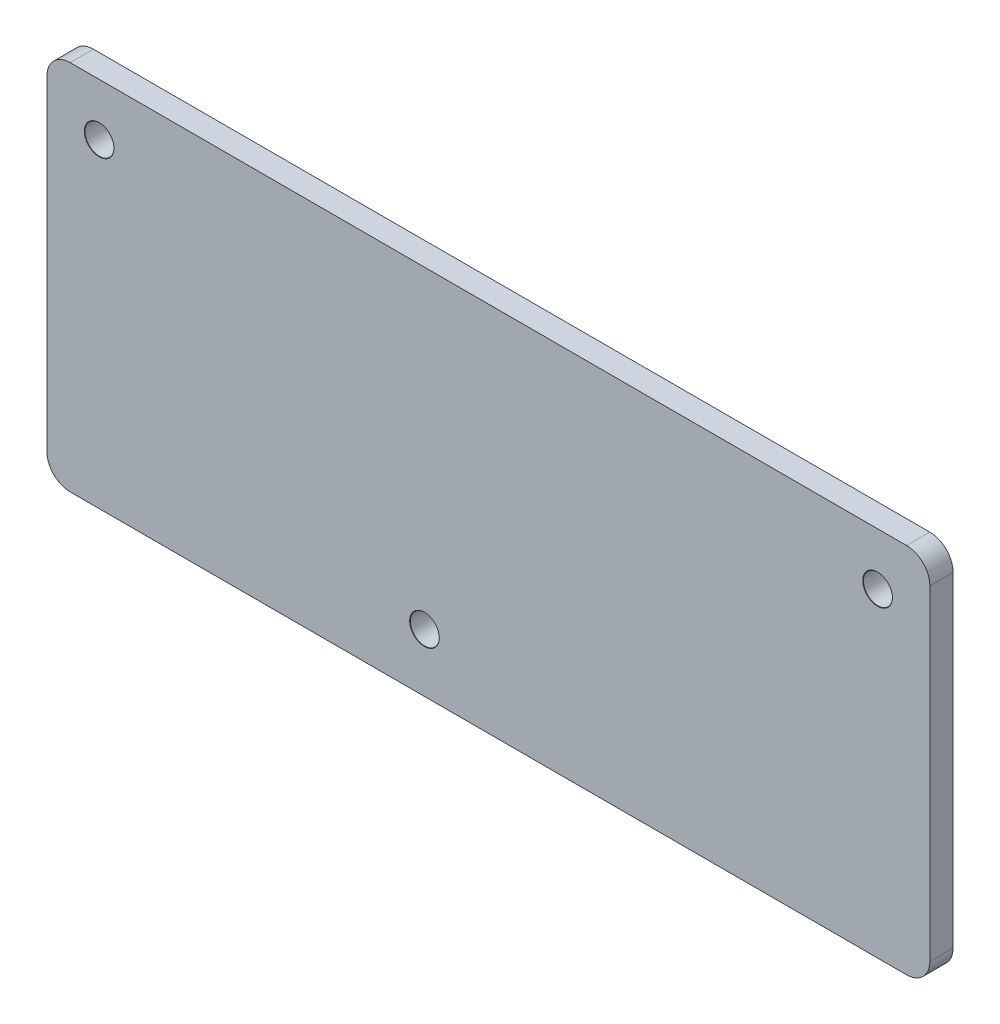
ISO-10303-21;
HEADER;
FILE_DESCRIPTION(('STEP AP214'),'2;1');
FILE_NAME('part.step','',(''),(''),'','','');
FILE_SCHEMA(('AUTOMOTIVE_DESIGN { 1 0 10303 214 1 1 1 1 }'));
ENDSEC;
DATA;
#1=APPLICATION_CONTEXT('core data for automotive mechanical design processes');
#2=APPLICATION_PROTOCOL_DEFINITION('international standard','automotive_design',2000,#1);
#3=PRODUCT_CONTEXT('',#1,'mechanical');
#4=PRODUCT('Part','Part','',(#3));
#5=PRODUCT_RELATED_PRODUCT_CATEGORY('part','',(#4));
#6=PRODUCT_DEFINITION_FORMATION('','',#4);
#7=PRODUCT_DEFINITION_CONTEXT('part definition',#1,'design');
#8=PRODUCT_DEFINITION('design','',#6,#7);
#9=PRODUCT_DEFINITION_SHAPE('','',#8);
#10=(LENGTH_UNIT() NAMED_UNIT(*) SI_UNIT(.MILLI.,.METRE.));
#11=(NAMED_UNIT(*) PLANE_ANGLE_UNIT() SI_UNIT($,.RADIAN.));
#12=(NAMED_UNIT(*) SI_UNIT($,.STERADIAN.) SOLID_ANGLE_UNIT());
#13=UNCERTAINTY_MEASURE_WITH_UNIT(LENGTH_MEASURE(1.E-05),#10,'distance_accuracy_value','');
#14=(GEOMETRIC_REPRESENTATION_CONTEXT(3) GLOBAL_UNCERTAINTY_ASSIGNED_CONTEXT((#13)) GLOBAL_UNIT_ASSIGNED_CONTEXT((#10,
#11,#12)) REPRESENTATION_CONTEXT('',''));
#15=CARTESIAN_POINT('',(0.,0.,0.));
#16=DIRECTION('',(0.,0.,1.));
#17=DIRECTION('',(1.,0.,0.));
#18=AXIS2_PLACEMENT_3D('',#15,#16,#17);
#19=CARTESIAN_POINT('',(-36.,14.,2.));
#20=DIRECTION('',(0.,0.,-1.));
#21=DIRECTION('',(-1.,0.,0.));
#22=AXIS2_PLACEMENT_3D('',#19,#20,#21);
#23=CYLINDRICAL_SURFACE('',#22,2.);
#24=CARTESIAN_POINT('',(-36.,14.,0.));
#25=DIRECTION('',(0.,0.,1.));
#26=DIRECTION('',(1.,0.,0.));
#27=AXIS2_PLACEMENT_3D('',#24,#25,#26);
#28=CIRCLE('',#27,2.);
#29=CARTESIAN_POINT('',(-36.,16.,0.));
#30=VERTEX_POINT('',#29);
#31=CARTESIAN_POINT('',(-38.,14.,0.));
#32=VERTEX_POINT('',#31);
#33=EDGE_CURVE('E139',#30,#32,#28,.T.);
#34=ORIENTED_EDGE('',*,*,#33,.T.);
#35=DIRECTION('',(0.,0.,-1.));
#36=VECTOR('',#35,1.);
#37=CARTESIAN_POINT('',(-38.,14.,2.));
#38=LINE('',#37,#36);
#39=CARTESIAN_POINT('',(-38.,14.,2.));
#40=VERTEX_POINT('',#39);
#41=EDGE_CURVE('E11',#40,#32,#38,.T.);
#42=ORIENTED_EDGE('',*,*,#41,.F.);
#43=CARTESIAN_POINT('',(-36.,14.,2.));
#44=DIRECTION('',(0.,0.,1.));
#45=DIRECTION('',(1.,0.,0.));
#46=AXIS2_PLACEMENT_3D('',#43,#44,#45);
#47=CIRCLE('',#46,2.);
#48=CARTESIAN_POINT('',(-36.,16.,2.));
#49=VERTEX_POINT('',#48);
#50=EDGE_CURVE('E162',#49,#40,#47,.T.);
#51=ORIENTED_EDGE('',*,*,#50,.F.);
#52=DIRECTION('',(0.,0.,-1.));
#53=VECTOR('',#52,1.);
#54=CARTESIAN_POINT('',(-36.,16.,2.));
#55=LINE('',#54,#53);
#56=EDGE_CURVE('E135',#49,#30,#55,.T.);
#57=ORIENTED_EDGE('',*,*,#56,.T.);
#58=EDGE_LOOP('',(#34,#42,#51,#57));
#59=FACE_BOUND('',#58,.T.);
#60=ADVANCED_FACE('F38',(#59),#23,.T.);
#61=CARTESIAN_POINT('',(-38.,14.,2.));
#62=DIRECTION('',(1.,0.,0.));
#63=DIRECTION('',(0.,1.,0.));
#64=AXIS2_PLACEMENT_3D('',#61,#62,#63);
#65=PLANE('',#64);
#66=DIRECTION('',(0.,-1.,0.));
#67=VECTOR('',#66,1.);
#68=CARTESIAN_POINT('',(-38.,14.,0.));
#69=LINE('',#68,#67);
#70=CARTESIAN_POINT('',(-38.,-14.,0.));
#71=VERTEX_POINT('',#70);
#72=EDGE_CURVE('E143',#32,#71,#69,.T.);
#73=ORIENTED_EDGE('',*,*,#72,.T.);
#74=DIRECTION('',(0.,0.,-1.));
#75=VECTOR('',#74,1.);
#76=CARTESIAN_POINT('',(-38.,-14.,2.));
#77=LINE('',#76,#75);
#78=CARTESIAN_POINT('',(-38.,-14.,2.));
#79=VERTEX_POINT('',#78);
#80=EDGE_CURVE('E47',#79,#71,#77,.T.);
#81=ORIENTED_EDGE('',*,*,#80,.F.);
#82=DIRECTION('',(0.,-1.,0.));
#83=VECTOR('',#82,1.);
#84=CARTESIAN_POINT('',(-38.,14.,2.));
#85=LINE('',#84,#83);
#86=EDGE_CURVE('E98',#40,#79,#85,.T.);
#87=ORIENTED_EDGE('',*,*,#86,.F.);
#88=ORIENTED_EDGE('',*,*,#41,.T.);
#89=EDGE_LOOP('',(#73,#81,#87,#88));
#90=FACE_BOUND('',#89,.T.);
#91=ADVANCED_FACE('F269',(#90),#65,.F.);
#92=CARTESIAN_POINT('',(-36.,-14.,2.));
#93=DIRECTION('',(0.,0.,-1.));
#94=DIRECTION('',(-1.,0.,0.));
#95=AXIS2_PLACEMENT_3D('',#92,#93,#94);
#96=CYLINDRICAL_SURFACE('',#95,2.);
#97=CARTESIAN_POINT('',(-36.,-14.,0.));
#98=DIRECTION('',(0.,0.,1.));
#99=DIRECTION('',(1.,0.,0.));
#100=AXIS2_PLACEMENT_3D('',#97,#98,#99);
#101=CIRCLE('',#100,2.);
#102=CARTESIAN_POINT('',(-36.,-16.,0.));
#103=VERTEX_POINT('',#102);
#104=EDGE_CURVE('E147',#71,#103,#101,.T.);
#105=ORIENTED_EDGE('',*,*,#104,.T.);
#106=DIRECTION('',(0.,0.,-1.));
#107=VECTOR('',#106,1.);
#108=CARTESIAN_POINT('',(-36.,-16.,2.));
#109=LINE('',#108,#107);
#110=CARTESIAN_POINT('',(-36.,-16.,2.));
#111=VERTEX_POINT('',#110);
#112=EDGE_CURVE('E173',#111,#103,#109,.T.);
#113=ORIENTED_EDGE('',*,*,#112,.F.);
#114=CARTESIAN_POINT('',(-36.,-14.,2.));
#115=DIRECTION('',(0.,0.,1.));
#116=DIRECTION('',(1.,0.,0.));
#117=AXIS2_PLACEMENT_3D('',#114,#115,#116);
#118=CIRCLE('',#117,2.);
#119=EDGE_CURVE('E183',#79,#111,#118,.T.);
#120=ORIENTED_EDGE('',*,*,#119,.F.);
#121=ORIENTED_EDGE('',*,*,#80,.T.);
#122=EDGE_LOOP('',(#105,#113,#120,#121));
#123=FACE_BOUND('',#122,.T.);
#124=ADVANCED_FACE('F181',(#123),#96,.T.);
#125=CARTESIAN_POINT('',(-36.,-16.,2.));
#126=DIRECTION('',(0.,1.,0.));
#127=DIRECTION('',(0.,0.,1.));
#128=AXIS2_PLACEMENT_3D('',#125,#126,#127);
#129=PLANE('',#128);
#130=DIRECTION('',(1.,0.,0.));
#131=VECTOR('',#130,1.);
#132=CARTESIAN_POINT('',(-36.,-16.,0.));
#133=LINE('',#132,#131);
#134=CARTESIAN_POINT('',(36.,-16.,0.));
#135=VERTEX_POINT('',#134);
#136=EDGE_CURVE('E150',#103,#135,#133,.T.);
#137=ORIENTED_EDGE('',*,*,#136,.T.);
#138=DIRECTION('',(0.,0.,-1.));
#139=VECTOR('',#138,1.);
#140=CARTESIAN_POINT('',(36.,-16.,2.));
#141=LINE('',#140,#139);
#142=CARTESIAN_POINT('',(36.,-16.,2.));
#143=VERTEX_POINT('',#142);
#144=EDGE_CURVE('E169',#143,#135,#141,.T.);
#145=ORIENTED_EDGE('',*,*,#144,.F.);
#146=DIRECTION('',(1.,0.,0.));
#147=VECTOR('',#146,1.);
#148=CARTESIAN_POINT('',(-36.,-16.,2.));
#149=LINE('',#148,#147);
#150=EDGE_CURVE('E196',#111,#143,#149,.T.);
#151=ORIENTED_EDGE('',*,*,#150,.F.);
#152=ORIENTED_EDGE('',*,*,#112,.T.);
#153=EDGE_LOOP('',(#137,#145,#151,#152));
#154=FACE_BOUND('',#153,.T.);
#155=ADVANCED_FACE('F191',(#154),#129,.F.);
#156=CARTESIAN_POINT('',(36.,-14.,2.));
#157=DIRECTION('',(0.,0.,-1.));
#158=DIRECTION('',(-1.,0.,0.));
#159=AXIS2_PLACEMENT_3D('',#156,#157,#158);
#160=CYLINDRICAL_SURFACE('',#159,2.);
#161=CARTESIAN_POINT('',(36.,-14.,0.));
#162=DIRECTION('',(0.,0.,1.));
#163=DIRECTION('',(1.,0.,0.));
#164=AXIS2_PLACEMENT_3D('',#161,#162,#163);
#165=CIRCLE('',#164,2.);
#166=CARTESIAN_POINT('',(38.,-14.,0.));
#167=VERTEX_POINT('',#166);
#168=EDGE_CURVE('E153',#135,#167,#165,.T.);
#169=ORIENTED_EDGE('',*,*,#168,.T.);
#170=DIRECTION('',(0.,0.,-1.));
#171=VECTOR('',#170,1.);
#172=CARTESIAN_POINT('',(38.,-14.,2.));
#173=LINE('',#172,#171);
#174=CARTESIAN_POINT('',(38.,-14.,2.));
#175=VERTEX_POINT('',#174);
#176=EDGE_CURVE('E128',#175,#167,#173,.T.);
#177=ORIENTED_EDGE('',*,*,#176,.F.);
#178=CARTESIAN_POINT('',(36.,-14.,2.));
#179=DIRECTION('',(0.,0.,1.));
#180=DIRECTION('',(1.,0.,0.));
#181=AXIS2_PLACEMENT_3D('',#178,#179,#180);
#182=CIRCLE('',#181,2.);
#183=EDGE_CURVE('E117',#143,#175,#182,.T.);
#184=ORIENTED_EDGE('',*,*,#183,.F.);
#185=ORIENTED_EDGE('',*,*,#144,.T.);
#186=EDGE_LOOP('',(#169,#177,#184,#185));
#187=FACE_BOUND('',#186,.T.);
#188=ADVANCED_FACE('F194',(#187),#160,.T.);
#189=CARTESIAN_POINT('',(38.,-14.,2.));
#190=DIRECTION('',(-1.,0.,0.));
#191=DIRECTION('',(0.,-1.,0.));
#192=AXIS2_PLACEMENT_3D('',#189,#190,#191);
#193=PLANE('',#192);
#194=DIRECTION('',(0.,1.,0.));
#195=VECTOR('',#194,1.);
#196=CARTESIAN_POINT('',(38.,-14.,0.));
#197=LINE('',#196,#195);
#198=CARTESIAN_POINT('',(38.,14.,0.));
#199=VERTEX_POINT('',#198);
#200=EDGE_CURVE('E126',#167,#199,#197,.T.);
#201=ORIENTED_EDGE('',*,*,#200,.T.);
#202=DIRECTION('',(0.,0.,-1.));
#203=VECTOR('',#202,1.);
#204=CARTESIAN_POINT('',(38.,14.,2.));
#205=LINE('',#204,#203);
#206=CARTESIAN_POINT('',(38.,14.,2.));
#207=VERTEX_POINT('',#206);
#208=EDGE_CURVE('E123',#207,#199,#205,.T.);
#209=ORIENTED_EDGE('',*,*,#208,.F.);
#210=DIRECTION('',(0.,1.,0.));
#211=VECTOR('',#210,1.);
#212=CARTESIAN_POINT('',(38.,-14.,2.));
#213=LINE('',#212,#211);
#214=EDGE_CURVE('E111',#175,#207,#213,.T.);
#215=ORIENTED_EDGE('',*,*,#214,.F.);
#216=ORIENTED_EDGE('',*,*,#176,.T.);
#217=EDGE_LOOP('',(#201,#209,#215,#216));
#218=FACE_BOUND('',#217,.T.);
#219=ADVANCED_FACE('F124',(#218),#193,.F.);
#220=CARTESIAN_POINT('',(36.,14.,2.));
#221=DIRECTION('',(0.,0.,-1.));
#222=DIRECTION('',(-1.,0.,0.));
#223=AXIS2_PLACEMENT_3D('',#220,#221,#222);
#224=CYLINDRICAL_SURFACE('',#223,2.);
#225=CARTESIAN_POINT('',(36.,14.,0.));
#226=DIRECTION('',(0.,0.,1.));
#227=DIRECTION('',(1.,0.,0.));
#228=AXIS2_PLACEMENT_3D('',#225,#226,#227);
#229=CIRCLE('',#228,2.);
#230=CARTESIAN_POINT('',(36.,16.,0.));
#231=VERTEX_POINT('',#230);
#232=EDGE_CURVE('E84',#199,#231,#229,.T.);
#233=ORIENTED_EDGE('',*,*,#232,.T.);
#234=DIRECTION('',(0.,0.,-1.));
#235=VECTOR('',#234,1.);
#236=CARTESIAN_POINT('',(36.,16.,2.));
#237=LINE('',#236,#235);
#238=CARTESIAN_POINT('',(36.,16.,2.));
#239=VERTEX_POINT('',#238);
#240=EDGE_CURVE('E129',#239,#231,#237,.T.);
#241=ORIENTED_EDGE('',*,*,#240,.F.);
#242=CARTESIAN_POINT('',(36.,14.,2.));
#243=DIRECTION('',(0.,0.,1.));
#244=DIRECTION('',(1.,0.,0.));
#245=AXIS2_PLACEMENT_3D('',#242,#243,#244);
#246=CIRCLE('',#245,2.);
#247=EDGE_CURVE('E115',#207,#239,#246,.T.);
#248=ORIENTED_EDGE('',*,*,#247,.F.);
#249=ORIENTED_EDGE('',*,*,#208,.T.);
#250=EDGE_LOOP('',(#233,#241,#248,#249));
#251=FACE_BOUND('',#250,.T.);
#252=ADVANCED_FACE('F131',(#251),#224,.T.);
#253=CARTESIAN_POINT('',(36.,16.,2.));
#254=DIRECTION('',(0.,-1.,0.));
#255=DIRECTION('',(1.,0.,0.));
#256=AXIS2_PLACEMENT_3D('',#253,#254,#255);
#257=PLANE('',#256);
#258=DIRECTION('',(-1.,0.,0.));
#259=VECTOR('',#258,1.);
#260=CARTESIAN_POINT('',(36.,16.,0.));
#261=LINE('',#260,#259);
#262=EDGE_CURVE('E90',#231,#30,#261,.T.);
#263=ORIENTED_EDGE('',*,*,#262,.T.);
#264=ORIENTED_EDGE('',*,*,#56,.F.);
#265=DIRECTION('',(-1.,0.,0.));
#266=VECTOR('',#265,1.);
#267=CARTESIAN_POINT('',(36.,16.,2.));
#268=LINE('',#267,#266);
#269=EDGE_CURVE('E55',#239,#49,#268,.T.);
#270=ORIENTED_EDGE('',*,*,#269,.F.);
#271=ORIENTED_EDGE('',*,*,#240,.T.);
#272=EDGE_LOOP('',(#263,#264,#270,#271));
#273=FACE_BOUND('',#272,.T.);
#274=ADVANCED_FACE('F246',(#273),#257,.F.);
#275=CARTESIAN_POINT('',(-36.,14.,2.));
#276=DIRECTION('',(0.,0.,1.));
#277=DIRECTION('',(1.,0.,0.));
#278=AXIS2_PLACEMENT_3D('',#275,#276,#277);
#279=PLANE('',#278);
#280=CARTESIAN_POINT('',(-33.5,11.5,2.));
#281=DIRECTION('',(0.,0.,1.));
#282=DIRECTION('',(1.,0.,0.));
#283=AXIS2_PLACEMENT_3D('',#280,#281,#282);
#284=CIRCLE('',#283,1.275);
#285=CARTESIAN_POINT('',(-32.225,11.5,2.));
#286=VERTEX_POINT('',#285);
#287=EDGE_CURVE('E237',#286,#286,#284,.T.);
#288=ORIENTED_EDGE('',*,*,#287,.F.);
#289=EDGE_LOOP('',(#288));
#290=FACE_BOUND('',#289,.T.);
#291=CARTESIAN_POINT('',(-5.50000000000001,-11.,2.));
#292=DIRECTION('',(0.,0.,1.));
#293=DIRECTION('',(1.,0.,0.));
#294=AXIS2_PLACEMENT_3D('',#291,#292,#293);
#295=CIRCLE('',#294,1.275);
#296=CARTESIAN_POINT('',(-4.225,-11.,2.));
#297=VERTEX_POINT('',#296);
#298=EDGE_CURVE('E225',#297,#297,#295,.T.);
#299=ORIENTED_EDGE('',*,*,#298,.F.);
#300=EDGE_LOOP('',(#299));
#301=FACE_BOUND('',#300,.T.);
#302=CARTESIAN_POINT('',(33.5,11.5,2.));
#303=DIRECTION('',(0.,0.,1.));
#304=DIRECTION('',(1.,0.,0.));
#305=AXIS2_PLACEMENT_3D('',#302,#303,#304);
#306=CIRCLE('',#305,1.275);
#307=CARTESIAN_POINT('',(34.775,11.5,2.));
#308=VERTEX_POINT('',#307);
#309=EDGE_CURVE('E213',#308,#308,#306,.T.);
#310=ORIENTED_EDGE('',*,*,#309,.F.);
#311=EDGE_LOOP('',(#310));
#312=FACE_BOUND('',#311,.T.);
#313=ORIENTED_EDGE('',*,*,#50,.T.);
#314=ORIENTED_EDGE('',*,*,#86,.T.);
#315=ORIENTED_EDGE('',*,*,#119,.T.);
#316=ORIENTED_EDGE('',*,*,#150,.T.);
#317=ORIENTED_EDGE('',*,*,#183,.T.);
#318=ORIENTED_EDGE('',*,*,#214,.T.);
#319=ORIENTED_EDGE('',*,*,#247,.T.);
#320=ORIENTED_EDGE('',*,*,#269,.T.);
#321=EDGE_LOOP('',(#313,#314,#315,#316,#317,#318,#319,#320));
#322=FACE_BOUND('',#321,.T.);
#323=ADVANCED_FACE('F113',(#290,#301,#312,#322),#279,.T.);
#324=CARTESIAN_POINT('',(-36.,14.,0.));
#325=DIRECTION('',(0.,0.,1.));
#326=DIRECTION('',(1.,0.,0.));
#327=AXIS2_PLACEMENT_3D('',#324,#325,#326);
#328=PLANE('',#327);
#329=CARTESIAN_POINT('',(-33.5,11.5,0.));
#330=DIRECTION('',(0.,0.,1.));
#331=DIRECTION('',(1.,0.,0.));
#332=AXIS2_PLACEMENT_3D('',#329,#330,#331);
#333=CIRCLE('',#332,1.25);
#334=CARTESIAN_POINT('',(-32.25,11.5,0.));
#335=VERTEX_POINT('',#334);
#336=EDGE_CURVE('E229',#335,#335,#333,.T.);
#337=ORIENTED_EDGE('',*,*,#336,.T.);
#338=EDGE_LOOP('',(#337));
#339=FACE_BOUND('',#338,.T.);
#340=CARTESIAN_POINT('',(-5.50000000000001,-11.,0.));
#341=DIRECTION('',(0.,0.,1.));
#342=DIRECTION('',(1.,0.,0.));
#343=AXIS2_PLACEMENT_3D('',#340,#341,#342);
#344=CIRCLE('',#343,1.25);
#345=CARTESIAN_POINT('',(-4.25000000000001,-11.,0.));
#346=VERTEX_POINT('',#345);
#347=EDGE_CURVE('E217',#346,#346,#344,.T.);
#348=ORIENTED_EDGE('',*,*,#347,.T.);
#349=EDGE_LOOP('',(#348));
#350=FACE_BOUND('',#349,.T.);
#351=CARTESIAN_POINT('',(33.5,11.5,0.));
#352=DIRECTION('',(0.,0.,1.));
#353=DIRECTION('',(1.,0.,0.));
#354=AXIS2_PLACEMENT_3D('',#351,#352,#353);
#355=CIRCLE('',#354,1.25);
#356=CARTESIAN_POINT('',(34.75,11.5,0.));
#357=VERTEX_POINT('',#356);
#358=EDGE_CURVE('E144',#357,#357,#355,.T.);
#359=ORIENTED_EDGE('',*,*,#358,.T.);
#360=EDGE_LOOP('',(#359));
#361=FACE_BOUND('',#360,.T.);
#362=ORIENTED_EDGE('',*,*,#33,.F.);
#363=ORIENTED_EDGE('',*,*,#262,.F.);
#364=ORIENTED_EDGE('',*,*,#232,.F.);
#365=ORIENTED_EDGE('',*,*,#200,.F.);
#366=ORIENTED_EDGE('',*,*,#168,.F.);
#367=ORIENTED_EDGE('',*,*,#136,.F.);
#368=ORIENTED_EDGE('',*,*,#104,.F.);
#369=ORIENTED_EDGE('',*,*,#72,.F.);
#370=EDGE_LOOP('',(#362,#363,#364,#365,#366,#367,#368,#369));
#371=FACE_BOUND('',#370,.T.);
#372=ADVANCED_FACE('F187',(#339,#350,#361,#371),#328,.F.);
#373=CARTESIAN_POINT('',(33.5,11.5,2.));
#374=DIRECTION('',(0.,0.,1.));
#375=DIRECTION('',(1.,0.,0.));
#376=AXIS2_PLACEMENT_3D('',#373,#374,#375);
#377=CYLINDRICAL_SURFACE('',#376,1.25);
#378=ORIENTED_EDGE('',*,*,#358,.F.);
#379=EDGE_LOOP('',(#378));
#380=FACE_BOUND('',#379,.T.);
#381=CARTESIAN_POINT('',(33.5,11.5,1.975));
#382=DIRECTION('',(0.,0.,1.));
#383=DIRECTION('',(1.,0.,0.));
#384=AXIS2_PLACEMENT_3D('',#381,#382,#383);
#385=CIRCLE('',#384,1.25);
#386=CARTESIAN_POINT('',(34.75,11.5,1.975));
#387=VERTEX_POINT('',#386);
#388=EDGE_CURVE('E209',#387,#387,#385,.T.);
#389=ORIENTED_EDGE('',*,*,#388,.T.);
#390=EDGE_LOOP('',(#389));
#391=FACE_BOUND('',#390,.T.);
#392=ADVANCED_FACE('F255',(#380,#391),#377,.F.);
#393=CARTESIAN_POINT('',(33.5,11.5,2.));
#394=DIRECTION('',(0.,0.,1.));
#395=DIRECTION('',(1.,0.,0.));
#396=AXIS2_PLACEMENT_3D('',#393,#394,#395);
#397=CONICAL_SURFACE('',#396,1.275,0.78539816339731);
#398=ORIENTED_EDGE('',*,*,#388,.F.);
#399=EDGE_LOOP('',(#398));
#400=FACE_BOUND('',#399,.T.);
#401=ORIENTED_EDGE('',*,*,#309,.T.);
#402=EDGE_LOOP('',(#401));
#403=FACE_BOUND('',#402,.T.);
#404=ADVANCED_FACE('F252',(#400,#403),#397,.F.);
#405=CARTESIAN_POINT('',(-5.50000000000001,-11.,2.));
#406=DIRECTION('',(0.,0.,1.));
#407=DIRECTION('',(1.,0.,0.));
#408=AXIS2_PLACEMENT_3D('',#405,#406,#407);
#409=CYLINDRICAL_SURFACE('',#408,1.25);
#410=ORIENTED_EDGE('',*,*,#347,.F.);
#411=EDGE_LOOP('',(#410));
#412=FACE_BOUND('',#411,.T.);
#413=CARTESIAN_POINT('',(-5.50000000000001,-11.,1.975));
#414=DIRECTION('',(0.,0.,1.));
#415=DIRECTION('',(1.,0.,0.));
#416=AXIS2_PLACEMENT_3D('',#413,#414,#415);
#417=CIRCLE('',#416,1.25);
#418=CARTESIAN_POINT('',(-4.25000000000001,-11.,1.975));
#419=VERTEX_POINT('',#418);
#420=EDGE_CURVE('E221',#419,#419,#417,.T.);
#421=ORIENTED_EDGE('',*,*,#420,.T.);
#422=EDGE_LOOP('',(#421));
#423=FACE_BOUND('',#422,.T.);
#424=ADVANCED_FACE('F254',(#412,#423),#409,.F.);
#425=CARTESIAN_POINT('',(-5.50000000000001,-11.,2.));
#426=DIRECTION('',(0.,0.,1.));
#427=DIRECTION('',(1.,0.,0.));
#428=AXIS2_PLACEMENT_3D('',#425,#426,#427);
#429=CONICAL_SURFACE('',#428,1.275,0.785398163397396);
#430=ORIENTED_EDGE('',*,*,#420,.F.);
#431=EDGE_LOOP('',(#430));
#432=FACE_BOUND('',#431,.T.);
#433=ORIENTED_EDGE('',*,*,#298,.T.);
#434=EDGE_LOOP('',(#433));
#435=FACE_BOUND('',#434,.T.);
#436=ADVANCED_FACE('F262',(#432,#435),#429,.F.);
#437=CARTESIAN_POINT('',(-33.5,11.5,2.));
#438=DIRECTION('',(0.,0.,1.));
#439=DIRECTION('',(1.,0.,0.));
#440=AXIS2_PLACEMENT_3D('',#437,#438,#439);
#441=CYLINDRICAL_SURFACE('',#440,1.25);
#442=ORIENTED_EDGE('',*,*,#336,.F.);
#443=EDGE_LOOP('',(#442));
#444=FACE_BOUND('',#443,.T.);
#445=CARTESIAN_POINT('',(-33.5,11.5,1.975));
#446=DIRECTION('',(0.,0.,1.));
#447=DIRECTION('',(1.,0.,0.));
#448=AXIS2_PLACEMENT_3D('',#445,#446,#447);
#449=CIRCLE('',#448,1.25);
#450=CARTESIAN_POINT('',(-32.25,11.5,1.975));
#451=VERTEX_POINT('',#450);
#452=EDGE_CURVE('E233',#451,#451,#449,.T.);
#453=ORIENTED_EDGE('',*,*,#452,.T.);
#454=EDGE_LOOP('',(#453));
#455=FACE_BOUND('',#454,.T.);
#456=ADVANCED_FACE('F354',(#444,#455),#441,.F.);
#457=CARTESIAN_POINT('',(-33.5,11.5,2.));
#458=DIRECTION('',(0.,0.,1.));
#459=DIRECTION('',(1.,0.,0.));
#460=AXIS2_PLACEMENT_3D('',#457,#458,#459);
#461=CONICAL_SURFACE('',#460,1.275,0.78539816339731);
#462=ORIENTED_EDGE('',*,*,#452,.F.);
#463=EDGE_LOOP('',(#462));
#464=FACE_BOUND('',#463,.T.);
#465=ORIENTED_EDGE('',*,*,#287,.T.);
#466=EDGE_LOOP('',(#465));
#467=FACE_BOUND('',#466,.T.);
#468=ADVANCED_FACE('F242',(#464,#467),#461,.F.);
#469=CLOSED_SHELL('',(#60,#91,#124,#155,#188,#219,#252,#274,#323,#372,#392,#404,#424,#436,#456,#468));
#470=MANIFOLD_SOLID_BREP('B2',#469);
#471=ADVANCED_BREP_SHAPE_REPRESENTATION('',(#18,#470),#14);
#472=SHAPE_DEFINITION_REPRESENTATION(#9,#471);
ENDSEC;
END-ISO-10303-21;
